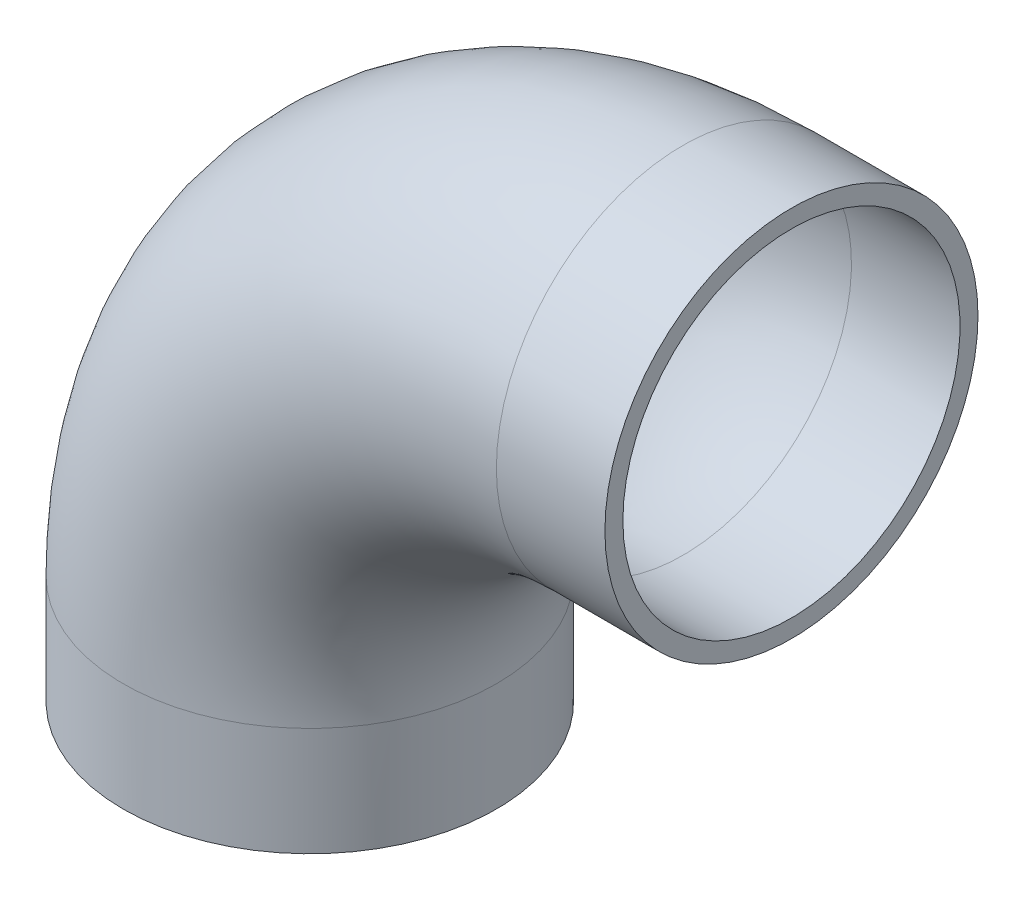
ISO-10303-21;
HEADER;
FILE_DESCRIPTION(('STEP AP214'),'2;1');
FILE_NAME('part.step','',(''),(''),'','','');
FILE_SCHEMA(('AUTOMOTIVE_DESIGN { 1 0 10303 214 1 1 1 1 }'));
ENDSEC;
DATA;
#1=APPLICATION_CONTEXT('core data for automotive mechanical design processes');
#2=APPLICATION_PROTOCOL_DEFINITION('international standard','automotive_design',2000,#1);
#3=PRODUCT_CONTEXT('',#1,'mechanical');
#4=PRODUCT('Part','Part','',(#3));
#5=PRODUCT_RELATED_PRODUCT_CATEGORY('part','',(#4));
#6=PRODUCT_DEFINITION_FORMATION('','',#4);
#7=PRODUCT_DEFINITION_CONTEXT('part definition',#1,'design');
#8=PRODUCT_DEFINITION('design','',#6,#7);
#9=PRODUCT_DEFINITION_SHAPE('','',#8);
#10=(LENGTH_UNIT() NAMED_UNIT(*) SI_UNIT(.MILLI.,.METRE.));
#11=(NAMED_UNIT(*) PLANE_ANGLE_UNIT() SI_UNIT($,.RADIAN.));
#12=(NAMED_UNIT(*) SI_UNIT($,.STERADIAN.) SOLID_ANGLE_UNIT());
#13=UNCERTAINTY_MEASURE_WITH_UNIT(LENGTH_MEASURE(1.E-05),#10,'distance_accuracy_value','');
#14=(GEOMETRIC_REPRESENTATION_CONTEXT(3) GLOBAL_UNCERTAINTY_ASSIGNED_CONTEXT((#13)) GLOBAL_UNIT_ASSIGNED_CONTEXT((#10,
#11,#12)) REPRESENTATION_CONTEXT('',''));
#15=CARTESIAN_POINT('',(0.,0.,0.));
#16=DIRECTION('',(0.,0.,1.));
#17=DIRECTION('',(1.,0.,0.));
#18=AXIS2_PLACEMENT_3D('',#15,#16,#17);
#19=CARTESIAN_POINT('',(110.,32.,0.));
#20=DIRECTION('',(0.,0.,1.));
#21=DIRECTION('',(1.,0.,0.));
#22=AXIS2_PLACEMENT_3D('',#19,#20,#21);
#23=TOROIDAL_SURFACE('',#22,110.,49.7);
#24=CARTESIAN_POINT('',(110.,142.,0.));
#25=DIRECTION('',(-1.,0.,0.));
#26=DIRECTION('',(0.,1.,0.));
#27=AXIS2_PLACEMENT_3D('',#24,#25,#26);
#28=CIRCLE('',#27,49.7);
#29=CARTESIAN_POINT('',(110.,191.7,0.));
#30=VERTEX_POINT('',#29);
#31=EDGE_CURVE('E33',#30,#30,#28,.T.);
#32=ORIENTED_EDGE('',*,*,#31,.F.);
#33=EDGE_LOOP('',(#32));
#34=FACE_BOUND('',#33,.T.);
#35=CARTESIAN_POINT('',(0.,32.,0.));
#36=DIRECTION('',(0.,-1.,0.));
#37=DIRECTION('',(-1.,0.,0.));
#38=AXIS2_PLACEMENT_3D('',#35,#36,#37);
#39=CIRCLE('',#38,49.7);
#40=CARTESIAN_POINT('',(-49.7,32.,0.));
#41=VERTEX_POINT('',#40);
#42=EDGE_CURVE('E31',#41,#41,#39,.F.);
#43=ORIENTED_EDGE('',*,*,#42,.F.);
#44=EDGE_LOOP('',(#43));
#45=FACE_BOUND('',#44,.T.);
#46=ADVANCED_FACE('F13',(#34,#45),#23,.F.);
#47=CARTESIAN_POINT('',(142.,142.,0.));
#48=DIRECTION('',(-1.,0.,0.));
#49=DIRECTION('',(0.,0.,1.));
#50=AXIS2_PLACEMENT_3D('',#47,#48,#49);
#51=CYLINDRICAL_SURFACE('',#50,49.7);
#52=CARTESIAN_POINT('',(142.,142.,0.));
#53=DIRECTION('',(-1.,0.,0.));
#54=DIRECTION('',(0.,0.,1.));
#55=AXIS2_PLACEMENT_3D('',#52,#53,#54);
#56=CIRCLE('',#55,49.7);
#57=CARTESIAN_POINT('',(142.,142.,49.7));
#58=VERTEX_POINT('',#57);
#59=EDGE_CURVE('E17',#58,#58,#56,.T.);
#60=ORIENTED_EDGE('',*,*,#59,.F.);
#61=EDGE_LOOP('',(#60));
#62=FACE_BOUND('',#61,.T.);
#63=ORIENTED_EDGE('',*,*,#31,.T.);
#64=EDGE_LOOP('',(#63));
#65=FACE_BOUND('',#64,.T.);
#66=ADVANCED_FACE('F52',(#62,#65),#51,.F.);
#67=CARTESIAN_POINT('',(0.,32.,0.));
#68=DIRECTION('',(0.,-1.,0.));
#69=DIRECTION('',(0.,0.,-1.));
#70=AXIS2_PLACEMENT_3D('',#67,#68,#69);
#71=CYLINDRICAL_SURFACE('',#70,49.7);
#72=ORIENTED_EDGE('',*,*,#42,.T.);
#73=EDGE_LOOP('',(#72));
#74=FACE_BOUND('',#73,.T.);
#75=CARTESIAN_POINT('',(0.,0.,0.));
#76=DIRECTION('',(0.,-1.,0.));
#77=DIRECTION('',(0.,0.,-1.));
#78=AXIS2_PLACEMENT_3D('',#75,#76,#77);
#79=CIRCLE('',#78,49.7);
#80=CARTESIAN_POINT('',(0.,0.,-49.7));
#81=VERTEX_POINT('',#80);
#82=EDGE_CURVE('E42',#81,#81,#79,.F.);
#83=ORIENTED_EDGE('',*,*,#82,.F.);
#84=EDGE_LOOP('',(#83));
#85=FACE_BOUND('',#84,.T.);
#86=ADVANCED_FACE('F55',(#74,#85),#71,.F.);
#87=CARTESIAN_POINT('',(142.,197.,55.6600021084419));
#88=DIRECTION('',(1.,0.,0.));
#89=DIRECTION('',(0.,-1.,0.));
#90=AXIS2_PLACEMENT_3D('',#87,#88,#89);
#91=PLANE('',#90);
#92=ORIENTED_EDGE('',*,*,#59,.T.);
#93=EDGE_LOOP('',(#92));
#94=FACE_BOUND('',#93,.T.);
#95=CARTESIAN_POINT('',(142.,142.,0.));
#96=DIRECTION('',(-1.,0.,0.));
#97=DIRECTION('',(0.,0.,1.));
#98=AXIS2_PLACEMENT_3D('',#95,#96,#97);
#99=CIRCLE('',#98,55.);
#100=CARTESIAN_POINT('',(142.,142.,55.));
#101=VERTEX_POINT('',#100);
#102=EDGE_CURVE('E40',#101,#101,#99,.T.);
#103=ORIENTED_EDGE('',*,*,#102,.F.);
#104=EDGE_LOOP('',(#103));
#105=FACE_BOUND('',#104,.T.);
#106=ADVANCED_FACE('F49',(#94,#105),#91,.T.);
#107=CARTESIAN_POINT('',(55.,0.,55.660002108352));
#108=DIRECTION('',(0.,-1.,0.));
#109=DIRECTION('',(-1.,0.,0.));
#110=AXIS2_PLACEMENT_3D('',#107,#108,#109);
#111=PLANE('',#110);
#112=ORIENTED_EDGE('',*,*,#82,.T.);
#113=EDGE_LOOP('',(#112));
#114=FACE_BOUND('',#113,.T.);
#115=CARTESIAN_POINT('',(0.,0.,0.));
#116=DIRECTION('',(0.,-1.,0.));
#117=DIRECTION('',(0.,0.,-1.));
#118=AXIS2_PLACEMENT_3D('',#115,#116,#117);
#119=CIRCLE('',#118,55.);
#120=CARTESIAN_POINT('',(0.,0.,-55.));
#121=VERTEX_POINT('',#120);
#122=EDGE_CURVE('E26',#121,#121,#119,.F.);
#123=ORIENTED_EDGE('',*,*,#122,.F.);
#124=EDGE_LOOP('',(#123));
#125=FACE_BOUND('',#124,.T.);
#126=ADVANCED_FACE('F69',(#114,#125),#111,.T.);
#127=CARTESIAN_POINT('',(110.,142.,0.));
#128=DIRECTION('',(-1.,0.,0.));
#129=DIRECTION('',(0.,0.,1.));
#130=AXIS2_PLACEMENT_3D('',#127,#128,#129);
#131=CYLINDRICAL_SURFACE('',#130,55.);
#132=ORIENTED_EDGE('',*,*,#102,.T.);
#133=EDGE_LOOP('',(#132));
#134=FACE_BOUND('',#133,.T.);
#135=CARTESIAN_POINT('',(110.,142.,0.));
#136=DIRECTION('',(-1.,0.,0.));
#137=DIRECTION('',(0.,-1.,0.));
#138=AXIS2_PLACEMENT_3D('',#135,#136,#137);
#139=CIRCLE('',#138,55.);
#140=CARTESIAN_POINT('',(110.,87.,0.));
#141=VERTEX_POINT('',#140);
#142=EDGE_CURVE('E21',#141,#141,#139,.T.);
#143=ORIENTED_EDGE('',*,*,#142,.F.);
#144=EDGE_LOOP('',(#143));
#145=FACE_BOUND('',#144,.T.);
#146=ADVANCED_FACE('F79',(#134,#145),#131,.T.);
#147=CARTESIAN_POINT('',(0.,0.,0.));
#148=DIRECTION('',(0.,-1.,0.));
#149=DIRECTION('',(0.,0.,-1.));
#150=AXIS2_PLACEMENT_3D('',#147,#148,#149);
#151=CYLINDRICAL_SURFACE('',#150,55.);
#152=CARTESIAN_POINT('',(0.,32.,0.));
#153=DIRECTION('',(0.,-1.,0.));
#154=DIRECTION('',(1.,0.,0.));
#155=AXIS2_PLACEMENT_3D('',#152,#153,#154);
#156=CIRCLE('',#155,55.);
#157=CARTESIAN_POINT('',(55.,32.,0.));
#158=VERTEX_POINT('',#157);
#159=EDGE_CURVE('E8',#158,#158,#156,.F.);
#160=ORIENTED_EDGE('',*,*,#159,.F.);
#161=EDGE_LOOP('',(#160));
#162=FACE_BOUND('',#161,.T.);
#163=ORIENTED_EDGE('',*,*,#122,.T.);
#164=EDGE_LOOP('',(#163));
#165=FACE_BOUND('',#164,.T.);
#166=ADVANCED_FACE('F73',(#162,#165),#151,.T.);
#167=CARTESIAN_POINT('',(110.,32.,0.));
#168=DIRECTION('',(0.,0.,1.));
#169=DIRECTION('',(1.,0.,0.));
#170=AXIS2_PLACEMENT_3D('',#167,#168,#169);
#171=TOROIDAL_SURFACE('',#170,110.,55.);
#172=ORIENTED_EDGE('',*,*,#142,.T.);
#173=EDGE_LOOP('',(#172));
#174=FACE_BOUND('',#173,.T.);
#175=ORIENTED_EDGE('',*,*,#159,.T.);
#176=EDGE_LOOP('',(#175));
#177=FACE_BOUND('',#176,.T.);
#178=ADVANCED_FACE('F71',(#174,#177),#171,.T.);
#179=CLOSED_SHELL('',(#46,#66,#86,#106,#126,#146,#166,#178));
#180=MANIFOLD_SOLID_BREP('B1',#179);
#181=ADVANCED_BREP_SHAPE_REPRESENTATION('',(#18,#180),#14);
#182=SHAPE_DEFINITION_REPRESENTATION(#9,#181);
ENDSEC;
END-ISO-10303-21;
